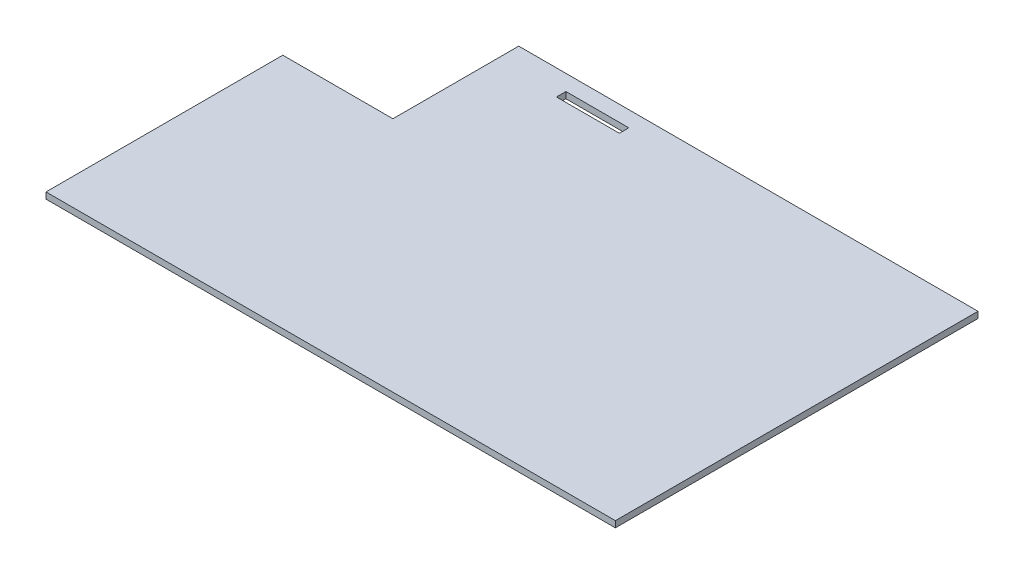
ISO-10303-21;
HEADER;
FILE_DESCRIPTION(('STEP AP214'),'2;1');
FILE_NAME('part.step','',(''),(''),'','','');
FILE_SCHEMA(('AUTOMOTIVE_DESIGN { 1 0 10303 214 1 1 1 1 }'));
ENDSEC;
DATA;
#1=APPLICATION_CONTEXT('core data for automotive mechanical design processes');
#2=APPLICATION_PROTOCOL_DEFINITION('international standard','automotive_design',2000,#1);
#3=PRODUCT_CONTEXT('',#1,'mechanical');
#4=PRODUCT('Part','Part','',(#3));
#5=PRODUCT_RELATED_PRODUCT_CATEGORY('part','',(#4));
#6=PRODUCT_DEFINITION_FORMATION('','',#4);
#7=PRODUCT_DEFINITION_CONTEXT('part definition',#1,'design');
#8=PRODUCT_DEFINITION('design','',#6,#7);
#9=PRODUCT_DEFINITION_SHAPE('','',#8);
#10=(LENGTH_UNIT() NAMED_UNIT(*) SI_UNIT(.MILLI.,.METRE.));
#11=(NAMED_UNIT(*) PLANE_ANGLE_UNIT() SI_UNIT($,.RADIAN.));
#12=(NAMED_UNIT(*) SI_UNIT($,.STERADIAN.) SOLID_ANGLE_UNIT());
#13=UNCERTAINTY_MEASURE_WITH_UNIT(LENGTH_MEASURE(1.E-05),#10,'distance_accuracy_value','');
#14=(GEOMETRIC_REPRESENTATION_CONTEXT(3) GLOBAL_UNCERTAINTY_ASSIGNED_CONTEXT((#13)) GLOBAL_UNIT_ASSIGNED_CONTEXT((#10,
#11,#12)) REPRESENTATION_CONTEXT('',''));
#15=CARTESIAN_POINT('',(0.,0.,0.));
#16=DIRECTION('',(0.,0.,1.));
#17=DIRECTION('',(1.,0.,0.));
#18=AXIS2_PLACEMENT_3D('',#15,#16,#17);
#19=CARTESIAN_POINT('',(0.,2.54,0.));
#20=DIRECTION('',(0.,1.,0.));
#21=DIRECTION('',(0.,0.,1.));
#22=AXIS2_PLACEMENT_3D('',#19,#20,#21);
#23=PLANE('',#22);
#24=DIRECTION('',(0.,0.,-1.));
#25=VECTOR('',#24,1.);
#26=CARTESIAN_POINT('',(229.87,2.54,0.));
#27=LINE('',#26,#25);
#28=CARTESIAN_POINT('',(229.87,2.54,146.4056));
#29=VERTEX_POINT('',#28);
#30=CARTESIAN_POINT('',(229.87,2.54,0.));
#31=VERTEX_POINT('',#30);
#32=EDGE_CURVE('E148',#29,#31,#27,.T.);
#33=ORIENTED_EDGE('',*,*,#32,.T.);
#34=DIRECTION('',(-1.,0.,0.));
#35=VECTOR('',#34,1.);
#36=CARTESIAN_POINT('',(44.45,2.54,0.));
#37=LINE('',#36,#35);
#38=CARTESIAN_POINT('',(44.45,2.54,0.));
#39=VERTEX_POINT('',#38);
#40=EDGE_CURVE('E151',#31,#39,#37,.T.);
#41=ORIENTED_EDGE('',*,*,#40,.T.);
#42=DIRECTION('',(0.,0.,1.));
#43=VECTOR('',#42,1.);
#44=CARTESIAN_POINT('',(44.45,2.54,50.8));
#45=LINE('',#44,#43);
#46=CARTESIAN_POINT('',(44.45,2.54,50.8));
#47=VERTEX_POINT('',#46);
#48=EDGE_CURVE('E154',#39,#47,#45,.T.);
#49=ORIENTED_EDGE('',*,*,#48,.T.);
#50=DIRECTION('',(-1.,0.,0.));
#51=VECTOR('',#50,1.);
#52=CARTESIAN_POINT('',(0.,2.54,50.8));
#53=LINE('',#52,#51);
#54=CARTESIAN_POINT('',(0.,2.54,50.8));
#55=VERTEX_POINT('',#54);
#56=EDGE_CURVE('E156',#47,#55,#53,.T.);
#57=ORIENTED_EDGE('',*,*,#56,.T.);
#58=DIRECTION('',(0.,0.,1.));
#59=VECTOR('',#58,1.);
#60=CARTESIAN_POINT('',(0.,2.54,146.4056));
#61=LINE('',#60,#59);
#62=CARTESIAN_POINT('',(0.,2.54,146.4056));
#63=VERTEX_POINT('',#62);
#64=EDGE_CURVE('E158',#55,#63,#61,.T.);
#65=ORIENTED_EDGE('',*,*,#64,.T.);
#66=DIRECTION('',(1.,0.,0.));
#67=VECTOR('',#66,1.);
#68=CARTESIAN_POINT('',(0.,2.54,146.4056));
#69=LINE('',#68,#67);
#70=EDGE_CURVE('E160',#63,#29,#69,.T.);
#71=ORIENTED_EDGE('',*,*,#70,.T.);
#72=EDGE_LOOP('',(#33,#41,#49,#57,#65,#71));
#73=FACE_BOUND('',#72,.T.);
#74=DIRECTION('',(1.,0.,0.));
#75=VECTOR('',#74,1.);
#76=CARTESIAN_POINT('',(69.85,2.54,10.16));
#77=LINE('',#76,#75);
#78=CARTESIAN_POINT('',(69.85,2.54,10.16));
#79=VERTEX_POINT('',#78);
#80=CARTESIAN_POINT('',(95.25,2.54,10.16));
#81=VERTEX_POINT('',#80);
#82=EDGE_CURVE('E120',#79,#81,#77,.T.);
#83=ORIENTED_EDGE('',*,*,#82,.F.);
#84=DIRECTION('',(0.,0.,1.));
#85=VECTOR('',#84,1.);
#86=CARTESIAN_POINT('',(69.85,2.54,10.16));
#87=LINE('',#86,#85);
#88=CARTESIAN_POINT('',(69.85,2.54,6.35));
#89=VERTEX_POINT('',#88);
#90=EDGE_CURVE('E112',#89,#79,#87,.T.);
#91=ORIENTED_EDGE('',*,*,#90,.F.);
#92=DIRECTION('',(-1.,0.,0.));
#93=VECTOR('',#92,1.);
#94=CARTESIAN_POINT('',(69.85,2.54,6.35));
#95=LINE('',#94,#93);
#96=CARTESIAN_POINT('',(95.25,2.54,6.35));
#97=VERTEX_POINT('',#96);
#98=EDGE_CURVE('E134',#97,#89,#95,.T.);
#99=ORIENTED_EDGE('',*,*,#98,.F.);
#100=DIRECTION('',(0.,0.,-1.));
#101=VECTOR('',#100,1.);
#102=CARTESIAN_POINT('',(95.25,2.54,10.16));
#103=LINE('',#102,#101);
#104=EDGE_CURVE('E132',#81,#97,#103,.T.);
#105=ORIENTED_EDGE('',*,*,#104,.F.);
#106=EDGE_LOOP('',(#83,#91,#99,#105));
#107=FACE_BOUND('',#106,.T.);
#108=ADVANCED_FACE('F35',(#73,#107),#23,.T.);
#109=CARTESIAN_POINT('',(0.,0.,0.));
#110=DIRECTION('',(0.,1.,0.));
#111=DIRECTION('',(0.,0.,1.));
#112=AXIS2_PLACEMENT_3D('',#109,#110,#111);
#113=PLANE('',#112);
#114=DIRECTION('',(0.,0.,-1.));
#115=VECTOR('',#114,1.);
#116=CARTESIAN_POINT('',(229.87,0.,0.));
#117=LINE('',#116,#115);
#118=CARTESIAN_POINT('',(229.87,0.,146.4056));
#119=VERTEX_POINT('',#118);
#120=CARTESIAN_POINT('',(229.87,0.,0.));
#121=VERTEX_POINT('',#120);
#122=EDGE_CURVE('E128',#119,#121,#117,.T.);
#123=ORIENTED_EDGE('',*,*,#122,.F.);
#124=DIRECTION('',(1.,0.,0.));
#125=VECTOR('',#124,1.);
#126=CARTESIAN_POINT('',(0.,0.,146.4056));
#127=LINE('',#126,#125);
#128=CARTESIAN_POINT('',(0.,0.,146.4056));
#129=VERTEX_POINT('',#128);
#130=EDGE_CURVE('E152',#129,#119,#127,.T.);
#131=ORIENTED_EDGE('',*,*,#130,.F.);
#132=DIRECTION('',(0.,0.,1.));
#133=VECTOR('',#132,1.);
#134=CARTESIAN_POINT('',(0.,0.,146.4056));
#135=LINE('',#134,#133);
#136=CARTESIAN_POINT('',(0.,0.,50.8));
#137=VERTEX_POINT('',#136);
#138=EDGE_CURVE('E171',#137,#129,#135,.T.);
#139=ORIENTED_EDGE('',*,*,#138,.F.);
#140=DIRECTION('',(-1.,0.,0.));
#141=VECTOR('',#140,1.);
#142=CARTESIAN_POINT('',(0.,0.,50.8));
#143=LINE('',#142,#141);
#144=CARTESIAN_POINT('',(44.45,0.,50.8));
#145=VERTEX_POINT('',#144);
#146=EDGE_CURVE('E169',#145,#137,#143,.T.);
#147=ORIENTED_EDGE('',*,*,#146,.F.);
#148=DIRECTION('',(0.,0.,1.));
#149=VECTOR('',#148,1.);
#150=CARTESIAN_POINT('',(44.45,0.,50.8));
#151=LINE('',#150,#149);
#152=CARTESIAN_POINT('',(44.45,0.,0.));
#153=VERTEX_POINT('',#152);
#154=EDGE_CURVE('E167',#153,#145,#151,.T.);
#155=ORIENTED_EDGE('',*,*,#154,.F.);
#156=DIRECTION('',(-1.,0.,0.));
#157=VECTOR('',#156,1.);
#158=CARTESIAN_POINT('',(44.45,0.,0.));
#159=LINE('',#158,#157);
#160=EDGE_CURVE('E165',#121,#153,#159,.T.);
#161=ORIENTED_EDGE('',*,*,#160,.F.);
#162=EDGE_LOOP('',(#123,#131,#139,#147,#155,#161));
#163=FACE_BOUND('',#162,.T.);
#164=DIRECTION('',(0.,0.,1.));
#165=VECTOR('',#164,1.);
#166=CARTESIAN_POINT('',(69.85,0.,10.16));
#167=LINE('',#166,#165);
#168=CARTESIAN_POINT('',(69.85,0.,6.35));
#169=VERTEX_POINT('',#168);
#170=CARTESIAN_POINT('',(69.85,0.,10.16));
#171=VERTEX_POINT('',#170);
#172=EDGE_CURVE('E58',#169,#171,#167,.T.);
#173=ORIENTED_EDGE('',*,*,#172,.T.);
#174=DIRECTION('',(1.,0.,0.));
#175=VECTOR('',#174,1.);
#176=CARTESIAN_POINT('',(69.85,0.,10.16));
#177=LINE('',#176,#175);
#178=CARTESIAN_POINT('',(95.25,0.,10.16));
#179=VERTEX_POINT('',#178);
#180=EDGE_CURVE('E127',#171,#179,#177,.T.);
#181=ORIENTED_EDGE('',*,*,#180,.T.);
#182=DIRECTION('',(0.,0.,-1.));
#183=VECTOR('',#182,1.);
#184=CARTESIAN_POINT('',(95.25,0.,10.16));
#185=LINE('',#184,#183);
#186=CARTESIAN_POINT('',(95.25,0.,6.35));
#187=VERTEX_POINT('',#186);
#188=EDGE_CURVE('E140',#179,#187,#185,.T.);
#189=ORIENTED_EDGE('',*,*,#188,.T.);
#190=DIRECTION('',(-1.,0.,0.));
#191=VECTOR('',#190,1.);
#192=CARTESIAN_POINT('',(69.85,0.,6.35));
#193=LINE('',#192,#191);
#194=EDGE_CURVE('E121',#187,#169,#193,.T.);
#195=ORIENTED_EDGE('',*,*,#194,.T.);
#196=EDGE_LOOP('',(#173,#181,#189,#195));
#197=FACE_BOUND('',#196,.T.);
#198=ADVANCED_FACE('F195',(#163,#197),#113,.F.);
#199=CARTESIAN_POINT('',(229.87,2.54,0.));
#200=DIRECTION('',(-1.,0.,0.));
#201=DIRECTION('',(0.,0.,1.));
#202=AXIS2_PLACEMENT_3D('',#199,#200,#201);
#203=PLANE('',#202);
#204=ORIENTED_EDGE('',*,*,#122,.T.);
#205=DIRECTION('',(0.,-1.,0.));
#206=VECTOR('',#205,1.);
#207=CARTESIAN_POINT('',(229.87,2.54,0.));
#208=LINE('',#207,#206);
#209=EDGE_CURVE('E11',#31,#121,#208,.T.);
#210=ORIENTED_EDGE('',*,*,#209,.F.);
#211=ORIENTED_EDGE('',*,*,#32,.F.);
#212=DIRECTION('',(0.,-1.,0.));
#213=VECTOR('',#212,1.);
#214=CARTESIAN_POINT('',(229.87,2.54,146.4056));
#215=LINE('',#214,#213);
#216=EDGE_CURVE('E162',#29,#119,#215,.T.);
#217=ORIENTED_EDGE('',*,*,#216,.T.);
#218=EDGE_LOOP('',(#204,#210,#211,#217));
#219=FACE_BOUND('',#218,.T.);
#220=ADVANCED_FACE('F37',(#219),#203,.F.);
#221=CARTESIAN_POINT('',(44.45,2.54,0.));
#222=DIRECTION('',(0.,0.,1.));
#223=DIRECTION('',(1.,0.,0.));
#224=AXIS2_PLACEMENT_3D('',#221,#222,#223);
#225=PLANE('',#224);
#226=ORIENTED_EDGE('',*,*,#160,.T.);
#227=DIRECTION('',(0.,-1.,0.));
#228=VECTOR('',#227,1.);
#229=CARTESIAN_POINT('',(44.45,2.54,0.));
#230=LINE('',#229,#228);
#231=EDGE_CURVE('E43',#39,#153,#230,.T.);
#232=ORIENTED_EDGE('',*,*,#231,.F.);
#233=ORIENTED_EDGE('',*,*,#40,.F.);
#234=ORIENTED_EDGE('',*,*,#209,.T.);
#235=EDGE_LOOP('',(#226,#232,#233,#234));
#236=FACE_BOUND('',#235,.T.);
#237=ADVANCED_FACE('F212',(#236),#225,.F.);
#238=CARTESIAN_POINT('',(44.45,2.54,50.8));
#239=DIRECTION('',(1.,0.,0.));
#240=DIRECTION('',(0.,0.,-1.));
#241=AXIS2_PLACEMENT_3D('',#238,#239,#240);
#242=PLANE('',#241);
#243=ORIENTED_EDGE('',*,*,#154,.T.);
#244=DIRECTION('',(0.,-1.,0.));
#245=VECTOR('',#244,1.);
#246=CARTESIAN_POINT('',(44.45,2.54,50.8));
#247=LINE('',#246,#245);
#248=EDGE_CURVE('E182',#47,#145,#247,.T.);
#249=ORIENTED_EDGE('',*,*,#248,.F.);
#250=ORIENTED_EDGE('',*,*,#48,.F.);
#251=ORIENTED_EDGE('',*,*,#231,.T.);
#252=EDGE_LOOP('',(#243,#249,#250,#251));
#253=FACE_BOUND('',#252,.T.);
#254=ADVANCED_FACE('F189',(#253),#242,.F.);
#255=CARTESIAN_POINT('',(0.,2.54,50.8));
#256=DIRECTION('',(0.,0.,1.));
#257=DIRECTION('',(1.,0.,0.));
#258=AXIS2_PLACEMENT_3D('',#255,#256,#257);
#259=PLANE('',#258);
#260=ORIENTED_EDGE('',*,*,#146,.T.);
#261=DIRECTION('',(0.,-1.,0.));
#262=VECTOR('',#261,1.);
#263=CARTESIAN_POINT('',(0.,2.54,50.8));
#264=LINE('',#263,#262);
#265=EDGE_CURVE('E179',#55,#137,#264,.T.);
#266=ORIENTED_EDGE('',*,*,#265,.F.);
#267=ORIENTED_EDGE('',*,*,#56,.F.);
#268=ORIENTED_EDGE('',*,*,#248,.T.);
#269=EDGE_LOOP('',(#260,#266,#267,#268));
#270=FACE_BOUND('',#269,.T.);
#271=ADVANCED_FACE('F201',(#270),#259,.F.);
#272=CARTESIAN_POINT('',(0.,2.54,146.4056));
#273=DIRECTION('',(1.,0.,0.));
#274=DIRECTION('',(0.,0.,-1.));
#275=AXIS2_PLACEMENT_3D('',#272,#273,#274);
#276=PLANE('',#275);
#277=ORIENTED_EDGE('',*,*,#138,.T.);
#278=DIRECTION('',(0.,-1.,0.));
#279=VECTOR('',#278,1.);
#280=CARTESIAN_POINT('',(0.,2.54,146.4056));
#281=LINE('',#280,#279);
#282=EDGE_CURVE('E176',#63,#129,#281,.T.);
#283=ORIENTED_EDGE('',*,*,#282,.F.);
#284=ORIENTED_EDGE('',*,*,#64,.F.);
#285=ORIENTED_EDGE('',*,*,#265,.T.);
#286=EDGE_LOOP('',(#277,#283,#284,#285));
#287=FACE_BOUND('',#286,.T.);
#288=ADVANCED_FACE('F205',(#287),#276,.F.);
#289=CARTESIAN_POINT('',(0.,2.54,146.4056));
#290=DIRECTION('',(0.,0.,-1.));
#291=DIRECTION('',(-1.,0.,0.));
#292=AXIS2_PLACEMENT_3D('',#289,#290,#291);
#293=PLANE('',#292);
#294=ORIENTED_EDGE('',*,*,#130,.T.);
#295=ORIENTED_EDGE('',*,*,#216,.F.);
#296=ORIENTED_EDGE('',*,*,#70,.F.);
#297=ORIENTED_EDGE('',*,*,#282,.T.);
#298=EDGE_LOOP('',(#294,#295,#296,#297));
#299=FACE_BOUND('',#298,.T.);
#300=ADVANCED_FACE('F215',(#299),#293,.F.);
#301=CARTESIAN_POINT('',(69.85,2.54,10.16));
#302=DIRECTION('',(1.,0.,0.));
#303=DIRECTION('',(0.,0.,-1.));
#304=AXIS2_PLACEMENT_3D('',#301,#302,#303);
#305=PLANE('',#304);
#306=ORIENTED_EDGE('',*,*,#172,.F.);
#307=DIRECTION('',(0.,-1.,0.));
#308=VECTOR('',#307,1.);
#309=CARTESIAN_POINT('',(69.85,2.54,6.35));
#310=LINE('',#309,#308);
#311=EDGE_CURVE('E116',#89,#169,#310,.T.);
#312=ORIENTED_EDGE('',*,*,#311,.F.);
#313=ORIENTED_EDGE('',*,*,#90,.T.);
#314=DIRECTION('',(0.,-1.,0.));
#315=VECTOR('',#314,1.);
#316=CARTESIAN_POINT('',(69.85,2.54,10.16));
#317=LINE('',#316,#315);
#318=EDGE_CURVE('E115',#79,#171,#317,.T.);
#319=ORIENTED_EDGE('',*,*,#318,.T.);
#320=EDGE_LOOP('',(#306,#312,#313,#319));
#321=FACE_BOUND('',#320,.T.);
#322=ADVANCED_FACE('F114',(#321),#305,.T.);
#323=CARTESIAN_POINT('',(69.85,2.54,10.16));
#324=DIRECTION('',(0.,0.,-1.));
#325=DIRECTION('',(-1.,0.,0.));
#326=AXIS2_PLACEMENT_3D('',#323,#324,#325);
#327=PLANE('',#326);
#328=ORIENTED_EDGE('',*,*,#180,.F.);
#329=ORIENTED_EDGE('',*,*,#318,.F.);
#330=ORIENTED_EDGE('',*,*,#82,.T.);
#331=DIRECTION('',(0.,-1.,0.));
#332=VECTOR('',#331,1.);
#333=CARTESIAN_POINT('',(95.25,2.54,10.16));
#334=LINE('',#333,#332);
#335=EDGE_CURVE('E129',#81,#179,#334,.T.);
#336=ORIENTED_EDGE('',*,*,#335,.T.);
#337=EDGE_LOOP('',(#328,#329,#330,#336));
#338=FACE_BOUND('',#337,.T.);
#339=ADVANCED_FACE('F124',(#338),#327,.T.);
#340=CARTESIAN_POINT('',(95.25,2.54,10.16));
#341=DIRECTION('',(-1.,0.,0.));
#342=DIRECTION('',(0.,0.,1.));
#343=AXIS2_PLACEMENT_3D('',#340,#341,#342);
#344=PLANE('',#343);
#345=ORIENTED_EDGE('',*,*,#188,.F.);
#346=ORIENTED_EDGE('',*,*,#335,.F.);
#347=ORIENTED_EDGE('',*,*,#104,.T.);
#348=DIRECTION('',(0.,-1.,0.));
#349=VECTOR('',#348,1.);
#350=CARTESIAN_POINT('',(95.25,2.54,6.35));
#351=LINE('',#350,#349);
#352=EDGE_CURVE('E50',#97,#187,#351,.T.);
#353=ORIENTED_EDGE('',*,*,#352,.T.);
#354=EDGE_LOOP('',(#345,#346,#347,#353));
#355=FACE_BOUND('',#354,.T.);
#356=ADVANCED_FACE('F233',(#355),#344,.T.);
#357=CARTESIAN_POINT('',(69.85,2.54,6.35));
#358=DIRECTION('',(0.,0.,1.));
#359=DIRECTION('',(1.,0.,0.));
#360=AXIS2_PLACEMENT_3D('',#357,#358,#359);
#361=PLANE('',#360);
#362=ORIENTED_EDGE('',*,*,#194,.F.);
#363=ORIENTED_EDGE('',*,*,#352,.F.);
#364=ORIENTED_EDGE('',*,*,#98,.T.);
#365=ORIENTED_EDGE('',*,*,#311,.T.);
#366=EDGE_LOOP('',(#362,#363,#364,#365));
#367=FACE_BOUND('',#366,.T.);
#368=ADVANCED_FACE('F236',(#367),#361,.T.);
#369=CLOSED_SHELL('',(#108,#198,#220,#237,#254,#271,#288,#300,#322,#339,#356,#368));
#370=MANIFOLD_SOLID_BREP('B2',#369);
#371=ADVANCED_BREP_SHAPE_REPRESENTATION('',(#18,#370),#14);
#372=SHAPE_DEFINITION_REPRESENTATION(#9,#371);
ENDSEC;
END-ISO-10303-21;
